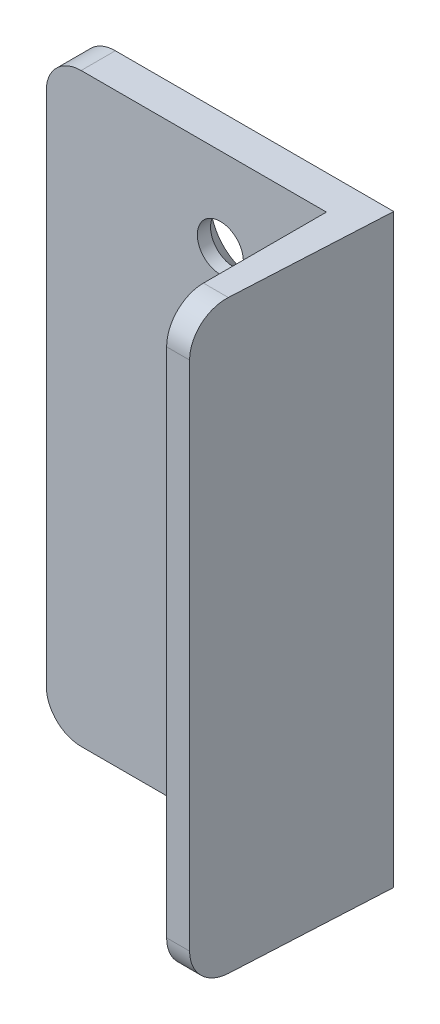
ISO-10303-21;
HEADER;
FILE_DESCRIPTION(('STEP AP214'),'2;1');
FILE_NAME('part.step','',(''),(''),'','','');
FILE_SCHEMA(('AUTOMOTIVE_DESIGN { 1 0 10303 214 1 1 1 1 }'));
ENDSEC;
DATA;
#1=APPLICATION_CONTEXT('core data for automotive mechanical design processes');
#2=APPLICATION_PROTOCOL_DEFINITION('international standard','automotive_design',2000,#1);
#3=PRODUCT_CONTEXT('',#1,'mechanical');
#4=PRODUCT('Part','Part','',(#3));
#5=PRODUCT_RELATED_PRODUCT_CATEGORY('part','',(#4));
#6=PRODUCT_DEFINITION_FORMATION('','',#4);
#7=PRODUCT_DEFINITION_CONTEXT('part definition',#1,'design');
#8=PRODUCT_DEFINITION('design','',#6,#7);
#9=PRODUCT_DEFINITION_SHAPE('','',#8);
#10=(LENGTH_UNIT() NAMED_UNIT(*) SI_UNIT(.MILLI.,.METRE.));
#11=(NAMED_UNIT(*) PLANE_ANGLE_UNIT() SI_UNIT($,.RADIAN.));
#12=(NAMED_UNIT(*) SI_UNIT($,.STERADIAN.) SOLID_ANGLE_UNIT());
#13=UNCERTAINTY_MEASURE_WITH_UNIT(LENGTH_MEASURE(1.E-05),#10,'distance_accuracy_value','');
#14=(GEOMETRIC_REPRESENTATION_CONTEXT(3) GLOBAL_UNCERTAINTY_ASSIGNED_CONTEXT((#13)) GLOBAL_UNIT_ASSIGNED_CONTEXT((#10,
#11,#12)) REPRESENTATION_CONTEXT('',''));
#15=CARTESIAN_POINT('',(0.,0.,0.));
#16=DIRECTION('',(0.,0.,1.));
#17=DIRECTION('',(1.,0.,0.));
#18=AXIS2_PLACEMENT_3D('',#15,#16,#17);
#19=CARTESIAN_POINT('',(-17.45,41.95,4.9));
#20=DIRECTION('',(0.,-1.,0.));
#21=DIRECTION('',(0.,0.,-1.));
#22=AXIS2_PLACEMENT_3D('',#19,#20,#21);
#23=PLANE('',#22);
#24=DIRECTION('',(-0.0523359562429439,0.,0.998629534754574));
#25=VECTOR('',#24,1.);
#26=CARTESIAN_POINT('',(22.45,41.95,0.));
#27=LINE('',#26,#25);
#28=CARTESIAN_POINT('',(22.45,41.95,0.));
#29=VERTEX_POINT('',#28);
#30=CARTESIAN_POINT('',(21.2694357276491,41.9499989350488,22.5265082493754));
#31=VERTEX_POINT('',#30);
#32=EDGE_CURVE('E120',#29,#31,#27,.T.);
#33=ORIENTED_EDGE('',*,*,#32,.F.);
#34=DIRECTION('',(-1.,0.,0.));
#35=VECTOR('',#34,1.);
#36=CARTESIAN_POINT('',(-17.45,41.95,0.));
#37=LINE('',#36,#35);
#38=CARTESIAN_POINT('',(-17.45,41.95,0.));
#39=VERTEX_POINT('',#38);
#40=EDGE_CURVE('E128',#29,#39,#37,.T.);
#41=ORIENTED_EDGE('',*,*,#40,.T.);
#42=DIRECTION('',(0.,0.,-1.));
#43=VECTOR('',#42,1.);
#44=CARTESIAN_POINT('',(-17.45,41.95,4.9));
#45=LINE('',#44,#43);
#46=CARTESIAN_POINT('',(-17.45,41.95,4.9));
#47=VERTEX_POINT('',#46);
#48=EDGE_CURVE('E164',#47,#39,#45,.T.);
#49=ORIENTED_EDGE('',*,*,#48,.F.);
#50=DIRECTION('',(-1.,0.,0.));
#51=VECTOR('',#50,1.);
#52=CARTESIAN_POINT('',(-17.45,41.95,4.9));
#53=LINE('',#52,#51);
#54=CARTESIAN_POINT('',(17.7,41.95,4.9));
#55=VERTEX_POINT('',#54);
#56=EDGE_CURVE('E153',#55,#47,#53,.T.);
#57=ORIENTED_EDGE('',*,*,#56,.F.);
#58=DIRECTION('',(0.,0.,-1.));
#59=VECTOR('',#58,1.);
#60=CARTESIAN_POINT('',(17.7,41.95,27.8));
#61=LINE('',#60,#59);
#62=CARTESIAN_POINT('',(17.7,41.95,22.5265082493754));
#63=VERTEX_POINT('',#62);
#64=EDGE_CURVE('E129',#63,#55,#61,.T.);
#65=ORIENTED_EDGE('',*,*,#64,.F.);
#66=DIRECTION('',(1.,0.,0.));
#67=VECTOR('',#66,1.);
#68=CARTESIAN_POINT('',(-5.3,41.95,22.5265082493754));
#69=LINE('',#68,#67);
#70=EDGE_CURVE('E136',#63,#31,#69,.T.);
#71=ORIENTED_EDGE('',*,*,#70,.T.);
#72=EDGE_LOOP('',(#33,#41,#49,#57,#65,#71));
#73=FACE_BOUND('',#72,.T.);
#74=ADVANCED_FACE('F43',(#73),#23,.F.);
#75=CARTESIAN_POINT('',(0.,0.,27.8));
#76=DIRECTION('',(0.,0.,-1.));
#77=DIRECTION('',(-1.,0.,0.));
#78=AXIS2_PLACEMENT_3D('',#75,#76,#77);
#79=PLANE('',#78);
#80=DIRECTION('',(0.,-1.,0.));
#81=VECTOR('',#80,1.);
#82=CARTESIAN_POINT('',(20.9930637359315,0.,27.8));
#83=LINE('',#82,#81);
#84=CARTESIAN_POINT('',(20.9930637359315,36.6765039895697,27.8));
#85=VERTEX_POINT('',#84);
#86=CARTESIAN_POINT('',(20.9930637359315,-36.6765061194722,27.8));
#87=VERTEX_POINT('',#86);
#88=EDGE_CURVE('E56',#85,#87,#83,.T.);
#89=ORIENTED_EDGE('',*,*,#88,.F.);
#90=DIRECTION('',(1.,0.,0.));
#91=VECTOR('',#90,1.);
#92=CARTESIAN_POINT('',(-5.3,36.6765039895697,27.8000015974273));
#93=LINE('',#92,#91);
#94=CARTESIAN_POINT('',(17.7,36.6765039895697,27.8));
#95=VERTEX_POINT('',#94);
#96=EDGE_CURVE('E63',#85,#95,#93,.F.);
#97=ORIENTED_EDGE('',*,*,#96,.T.);
#98=DIRECTION('',(0.,-1.,0.));
#99=VECTOR('',#98,1.);
#100=CARTESIAN_POINT('',(17.7,41.95,27.8));
#101=LINE('',#100,#99);
#102=CARTESIAN_POINT('',(17.7,-36.6765061194722,27.8));
#103=VERTEX_POINT('',#102);
#104=EDGE_CURVE('E174',#95,#103,#101,.T.);
#105=ORIENTED_EDGE('',*,*,#104,.T.);
#106=DIRECTION('',(1.,0.,0.));
#107=VECTOR('',#106,1.);
#108=CARTESIAN_POINT('',(-5.3,-36.6765061194722,27.8));
#109=LINE('',#108,#107);
#110=EDGE_CURVE('E50',#87,#103,#109,.F.);
#111=ORIENTED_EDGE('',*,*,#110,.F.);
#112=EDGE_LOOP('',(#89,#97,#105,#111));
#113=FACE_BOUND('',#112,.T.);
#114=ADVANCED_FACE('F175',(#113),#79,.F.);
#115=CARTESIAN_POINT('',(-17.45,-41.95,4.9));
#116=DIRECTION('',(0.,1.,0.));
#117=DIRECTION('',(0.,0.,1.));
#118=AXIS2_PLACEMENT_3D('',#115,#116,#117);
#119=PLANE('',#118);
#120=DIRECTION('',(0.0523359562429439,0.,-0.998629534754574));
#121=VECTOR('',#120,1.);
#122=CARTESIAN_POINT('',(22.45,-41.95,0.));
#123=LINE('',#122,#121);
#124=CARTESIAN_POINT('',(21.2694358392726,-41.95,22.5265061194722));
#125=VERTEX_POINT('',#124);
#126=CARTESIAN_POINT('',(22.45,-41.95,0.));
#127=VERTEX_POINT('',#126);
#128=EDGE_CURVE('E123',#125,#127,#123,.T.);
#129=ORIENTED_EDGE('',*,*,#128,.F.);
#130=DIRECTION('',(1.,0.,0.));
#131=VECTOR('',#130,1.);
#132=CARTESIAN_POINT('',(-5.3,-41.95,22.5265059343001));
#133=LINE('',#132,#131);
#134=CARTESIAN_POINT('',(17.7,-41.95,22.5265059343001));
#135=VERTEX_POINT('',#134);
#136=EDGE_CURVE('E187',#135,#125,#133,.T.);
#137=ORIENTED_EDGE('',*,*,#136,.F.);
#138=DIRECTION('',(0.,0.,-1.));
#139=VECTOR('',#138,1.);
#140=CARTESIAN_POINT('',(17.7,-41.95,27.8));
#141=LINE('',#140,#139);
#142=CARTESIAN_POINT('',(17.7,-41.95,4.9));
#143=VERTEX_POINT('',#142);
#144=EDGE_CURVE('E178',#135,#143,#141,.T.);
#145=ORIENTED_EDGE('',*,*,#144,.T.);
#146=DIRECTION('',(1.,0.,0.));
#147=VECTOR('',#146,1.);
#148=CARTESIAN_POINT('',(-17.45,-41.95,4.9));
#149=LINE('',#148,#147);
#150=CARTESIAN_POINT('',(-17.45,-41.95,4.9));
#151=VERTEX_POINT('',#150);
#152=EDGE_CURVE('E158',#151,#143,#149,.T.);
#153=ORIENTED_EDGE('',*,*,#152,.F.);
#154=DIRECTION('',(0.,0.,-1.));
#155=VECTOR('',#154,1.);
#156=CARTESIAN_POINT('',(-17.45,-41.95,4.9));
#157=LINE('',#156,#155);
#158=CARTESIAN_POINT('',(-17.45,-41.95,0.));
#159=VERTEX_POINT('',#158);
#160=EDGE_CURVE('E154',#151,#159,#157,.T.);
#161=ORIENTED_EDGE('',*,*,#160,.T.);
#162=DIRECTION('',(1.,0.,0.));
#163=VECTOR('',#162,1.);
#164=CARTESIAN_POINT('',(-17.45,-41.95,0.));
#165=LINE('',#164,#163);
#166=EDGE_CURVE('E151',#159,#127,#165,.T.);
#167=ORIENTED_EDGE('',*,*,#166,.T.);
#168=EDGE_LOOP('',(#129,#137,#145,#153,#161,#167));
#169=FACE_BOUND('',#168,.T.);
#170=ADVANCED_FACE('F219',(#169),#119,.F.);
#171=CARTESIAN_POINT('',(-5.3,36.6765039895697,22.5265082493754));
#172=DIRECTION('',(1.,0.,0.));
#173=DIRECTION('',(0.,0.,-1.));
#174=AXIS2_PLACEMENT_3D('',#171,#172,#173);
#175=CYLINDRICAL_SURFACE('',#174,5.27349494547906);
#176=CARTESIAN_POINT('',(21.2694357276491,36.6765039895697,22.5265082493754));
#177=DIRECTION('',(0.998629534754574,0.,0.0523359562429439));
#178=DIRECTION('',(0.052335956242944,0.,-0.998629534754574));
#179=AXIS2_PLACEMENT_3D('',#176,#177,#178);
#180=ELLIPSE('',#179,5.28073200516254,5.27349494547906);
#181=EDGE_CURVE('E241',#31,#85,#180,.T.);
#182=ORIENTED_EDGE('',*,*,#181,.F.);
#183=ORIENTED_EDGE('',*,*,#70,.F.);
#184=CARTESIAN_POINT('',(17.7,36.6765039895697,22.5265082493754));
#185=DIRECTION('',(1.,0.,0.));
#186=DIRECTION('',(0.,1.,0.));
#187=AXIS2_PLACEMENT_3D('',#184,#185,#186);
#188=CIRCLE('',#187,5.27349494547906);
#189=EDGE_CURVE('E184',#95,#63,#188,.F.);
#190=ORIENTED_EDGE('',*,*,#189,.F.);
#191=ORIENTED_EDGE('',*,*,#96,.F.);
#192=EDGE_LOOP('',(#182,#183,#190,#191));
#193=FACE_BOUND('',#192,.T.);
#194=ADVANCED_FACE('F244',(#193),#175,.T.);
#195=CARTESIAN_POINT('',(-5.3,-36.6765061194722,22.5265061194722));
#196=DIRECTION('',(1.,0.,0.));
#197=DIRECTION('',(0.,0.,-1.));
#198=AXIS2_PLACEMENT_3D('',#195,#196,#197);
#199=CYLINDRICAL_SURFACE('',#198,5.27349388052784);
#200=CARTESIAN_POINT('',(21.2694358392726,-36.6765061194722,22.5265061194722));
#201=DIRECTION('',(0.998629534754574,0.,0.0523359562429439));
#202=DIRECTION('',(0.052335956242944,0.,-0.998629534754574));
#203=AXIS2_PLACEMENT_3D('',#200,#201,#202);
#204=ELLIPSE('',#203,5.28073093874985,5.27349388052784);
#205=EDGE_CURVE('E11',#87,#125,#204,.T.);
#206=ORIENTED_EDGE('',*,*,#205,.F.);
#207=ORIENTED_EDGE('',*,*,#110,.T.);
#208=CARTESIAN_POINT('',(17.7,-36.6765061194722,22.5265061194722));
#209=DIRECTION('',(1.,0.,0.));
#210=DIRECTION('',(0.,1.,0.));
#211=AXIS2_PLACEMENT_3D('',#208,#209,#210);
#212=CIRCLE('',#211,5.27349388052784);
#213=EDGE_CURVE('E171',#135,#103,#212,.F.);
#214=ORIENTED_EDGE('',*,*,#213,.F.);
#215=ORIENTED_EDGE('',*,*,#136,.T.);
#216=EDGE_LOOP('',(#206,#207,#214,#215));
#217=FACE_BOUND('',#216,.T.);
#218=ADVANCED_FACE('F168',(#217),#199,.T.);
#219=CARTESIAN_POINT('',(-17.45,36.95,0.));
#220=DIRECTION('',(0.,0.,1.));
#221=DIRECTION('',(1.,0.,0.));
#222=AXIS2_PLACEMENT_3D('',#219,#220,#221);
#223=PLANE('',#222);
#224=DIRECTION('',(0.,1.,0.));
#225=VECTOR('',#224,1.);
#226=CARTESIAN_POINT('',(22.45,-41.95,0.));
#227=LINE('',#226,#225);
#228=EDGE_CURVE('E117',#127,#29,#227,.T.);
#229=ORIENTED_EDGE('',*,*,#228,.F.);
#230=ORIENTED_EDGE('',*,*,#166,.F.);
#231=CARTESIAN_POINT('',(-17.45,-36.95,0.));
#232=DIRECTION('',(0.,0.,1.));
#233=DIRECTION('',(1.,0.,0.));
#234=AXIS2_PLACEMENT_3D('',#231,#232,#233);
#235=CIRCLE('',#234,5.);
#236=CARTESIAN_POINT('',(-22.45,-36.95,0.));
#237=VERTEX_POINT('',#236);
#238=EDGE_CURVE('E149',#237,#159,#235,.T.);
#239=ORIENTED_EDGE('',*,*,#238,.F.);
#240=DIRECTION('',(0.,-1.,0.));
#241=VECTOR('',#240,1.);
#242=CARTESIAN_POINT('',(-22.45,-36.95,0.));
#243=LINE('',#242,#241);
#244=CARTESIAN_POINT('',(-22.45,36.95,0.));
#245=VERTEX_POINT('',#244);
#246=EDGE_CURVE('E144',#245,#237,#243,.T.);
#247=ORIENTED_EDGE('',*,*,#246,.F.);
#248=CARTESIAN_POINT('',(-17.45,36.95,0.));
#249=DIRECTION('',(0.,0.,1.));
#250=DIRECTION('',(1.,0.,0.));
#251=AXIS2_PLACEMENT_3D('',#248,#249,#250);
#252=CIRCLE('',#251,5.);
#253=EDGE_CURVE('E142',#39,#245,#252,.T.);
#254=ORIENTED_EDGE('',*,*,#253,.F.);
#255=ORIENTED_EDGE('',*,*,#40,.F.);
#256=EDGE_LOOP('',(#229,#230,#239,#247,#254,#255));
#257=FACE_BOUND('',#256,.T.);
#258=CARTESIAN_POINT('',(2.50000000000002,-29.8956518577535,0.));
#259=DIRECTION('',(0.,0.,-1.));
#260=DIRECTION('',(-1.,0.,0.));
#261=AXIS2_PLACEMENT_3D('',#258,#259,#260);
#262=CIRCLE('',#261,6.3);
#263=CARTESIAN_POINT('',(-3.79999999999998,-29.8956518577535,0.));
#264=VERTEX_POINT('',#263);
#265=EDGE_CURVE('E229',#264,#264,#262,.T.);
#266=ORIENTED_EDGE('',*,*,#265,.F.);
#267=EDGE_LOOP('',(#266));
#268=FACE_BOUND('',#267,.T.);
#269=CARTESIAN_POINT('',(2.50000000000002,29.8956518577535,0.));
#270=DIRECTION('',(0.,0.,-1.));
#271=DIRECTION('',(-1.,0.,0.));
#272=AXIS2_PLACEMENT_3D('',#269,#270,#271);
#273=CIRCLE('',#272,6.3);
#274=CARTESIAN_POINT('',(-3.79999999999998,29.8956518577535,0.));
#275=VERTEX_POINT('',#274);
#276=EDGE_CURVE('E238',#275,#275,#273,.T.);
#277=ORIENTED_EDGE('',*,*,#276,.F.);
#278=EDGE_LOOP('',(#277));
#279=FACE_BOUND('',#278,.T.);
#280=ADVANCED_FACE('F139',(#257,#268,#279),#223,.F.);
#281=CARTESIAN_POINT('',(-17.45,36.95,4.9));
#282=DIRECTION('',(0.,0.,-1.));
#283=DIRECTION('',(-1.,0.,0.));
#284=AXIS2_PLACEMENT_3D('',#281,#282,#283);
#285=CYLINDRICAL_SURFACE('',#284,5.);
#286=ORIENTED_EDGE('',*,*,#253,.T.);
#287=DIRECTION('',(0.,0.,-1.));
#288=VECTOR('',#287,1.);
#289=CARTESIAN_POINT('',(-22.45,36.95,4.9));
#290=LINE('',#289,#288);
#291=CARTESIAN_POINT('',(-22.45,36.95,4.9));
#292=VERTEX_POINT('',#291);
#293=EDGE_CURVE('E161',#292,#245,#290,.T.);
#294=ORIENTED_EDGE('',*,*,#293,.F.);
#295=CARTESIAN_POINT('',(-17.45,36.95,4.9));
#296=DIRECTION('',(0.,0.,1.));
#297=DIRECTION('',(1.,0.,0.));
#298=AXIS2_PLACEMENT_3D('',#295,#296,#297);
#299=CIRCLE('',#298,5.);
#300=EDGE_CURVE('E194',#47,#292,#299,.T.);
#301=ORIENTED_EDGE('',*,*,#300,.F.);
#302=ORIENTED_EDGE('',*,*,#48,.T.);
#303=EDGE_LOOP('',(#286,#294,#301,#302));
#304=FACE_BOUND('',#303,.T.);
#305=ADVANCED_FACE('F213',(#304),#285,.T.);
#306=CARTESIAN_POINT('',(-22.45,-36.95,4.9));
#307=DIRECTION('',(1.,0.,0.));
#308=DIRECTION('',(0.,0.,-1.));
#309=AXIS2_PLACEMENT_3D('',#306,#307,#308);
#310=PLANE('',#309);
#311=ORIENTED_EDGE('',*,*,#246,.T.);
#312=DIRECTION('',(0.,0.,-1.));
#313=VECTOR('',#312,1.);
#314=CARTESIAN_POINT('',(-22.45,-36.95,4.9));
#315=LINE('',#314,#313);
#316=CARTESIAN_POINT('',(-22.45,-36.95,4.9));
#317=VERTEX_POINT('',#316);
#318=EDGE_CURVE('E157',#317,#237,#315,.T.);
#319=ORIENTED_EDGE('',*,*,#318,.F.);
#320=DIRECTION('',(0.,-1.,0.));
#321=VECTOR('',#320,1.);
#322=CARTESIAN_POINT('',(-22.45,-36.95,4.9));
#323=LINE('',#322,#321);
#324=EDGE_CURVE('E196',#292,#317,#323,.T.);
#325=ORIENTED_EDGE('',*,*,#324,.F.);
#326=ORIENTED_EDGE('',*,*,#293,.T.);
#327=EDGE_LOOP('',(#311,#319,#325,#326));
#328=FACE_BOUND('',#327,.T.);
#329=ADVANCED_FACE('F215',(#328),#310,.F.);
#330=CARTESIAN_POINT('',(-17.45,-36.95,4.9));
#331=DIRECTION('',(0.,0.,-1.));
#332=DIRECTION('',(-1.,0.,0.));
#333=AXIS2_PLACEMENT_3D('',#330,#331,#332);
#334=CYLINDRICAL_SURFACE('',#333,5.);
#335=ORIENTED_EDGE('',*,*,#238,.T.);
#336=ORIENTED_EDGE('',*,*,#160,.F.);
#337=CARTESIAN_POINT('',(-17.45,-36.95,4.9));
#338=DIRECTION('',(0.,0.,1.));
#339=DIRECTION('',(1.,0.,0.));
#340=AXIS2_PLACEMENT_3D('',#337,#338,#339);
#341=CIRCLE('',#340,5.);
#342=EDGE_CURVE('E198',#317,#151,#341,.T.);
#343=ORIENTED_EDGE('',*,*,#342,.F.);
#344=ORIENTED_EDGE('',*,*,#318,.T.);
#345=EDGE_LOOP('',(#335,#336,#343,#344));
#346=FACE_BOUND('',#345,.T.);
#347=ADVANCED_FACE('F218',(#346),#334,.T.);
#348=CARTESIAN_POINT('',(-17.45,36.95,4.9));
#349=DIRECTION('',(0.,0.,1.));
#350=DIRECTION('',(1.,0.,0.));
#351=AXIS2_PLACEMENT_3D('',#348,#349,#350);
#352=PLANE('',#351);
#353=CARTESIAN_POINT('',(2.50000000000002,29.8956518577535,4.9));
#354=DIRECTION('',(0.,0.,1.));
#355=DIRECTION('',(1.,0.,0.));
#356=AXIS2_PLACEMENT_3D('',#353,#354,#355);
#357=CIRCLE('',#356,3.3);
#358=CARTESIAN_POINT('',(5.80000000000002,29.8956518577535,4.9));
#359=VERTEX_POINT('',#358);
#360=EDGE_CURVE('E232',#359,#359,#357,.T.);
#361=ORIENTED_EDGE('',*,*,#360,.F.);
#362=EDGE_LOOP('',(#361));
#363=FACE_BOUND('',#362,.T.);
#364=CARTESIAN_POINT('',(2.50000000000002,-29.8956518577535,4.9));
#365=DIRECTION('',(0.,0.,1.));
#366=DIRECTION('',(1.,0.,0.));
#367=AXIS2_PLACEMENT_3D('',#364,#365,#366);
#368=CIRCLE('',#367,3.3);
#369=CARTESIAN_POINT('',(5.80000000000001,-29.8956518577535,4.9));
#370=VERTEX_POINT('',#369);
#371=EDGE_CURVE('E222',#370,#370,#368,.T.);
#372=ORIENTED_EDGE('',*,*,#371,.F.);
#373=EDGE_LOOP('',(#372));
#374=FACE_BOUND('',#373,.T.);
#375=DIRECTION('',(0.,-1.,0.));
#376=VECTOR('',#375,1.);
#377=CARTESIAN_POINT('',(17.7,41.95,4.9));
#378=LINE('',#377,#376);
#379=EDGE_CURVE('E179',#55,#143,#378,.T.);
#380=ORIENTED_EDGE('',*,*,#379,.F.);
#381=ORIENTED_EDGE('',*,*,#56,.T.);
#382=ORIENTED_EDGE('',*,*,#300,.T.);
#383=ORIENTED_EDGE('',*,*,#324,.T.);
#384=ORIENTED_EDGE('',*,*,#342,.T.);
#385=ORIENTED_EDGE('',*,*,#152,.T.);
#386=EDGE_LOOP('',(#380,#381,#382,#383,#384,#385));
#387=FACE_BOUND('',#386,.T.);
#388=ADVANCED_FACE('F203',(#363,#374,#387),#352,.T.);
#389=CARTESIAN_POINT('',(17.7,41.95,27.8));
#390=DIRECTION('',(1.,0.,0.));
#391=DIRECTION('',(0.,1.,0.));
#392=AXIS2_PLACEMENT_3D('',#389,#390,#391);
#393=PLANE('',#392);
#394=ORIENTED_EDGE('',*,*,#144,.F.);
#395=ORIENTED_EDGE('',*,*,#213,.T.);
#396=ORIENTED_EDGE('',*,*,#104,.F.);
#397=ORIENTED_EDGE('',*,*,#189,.T.);
#398=ORIENTED_EDGE('',*,*,#64,.T.);
#399=ORIENTED_EDGE('',*,*,#379,.T.);
#400=EDGE_LOOP('',(#394,#395,#396,#397,#398,#399));
#401=FACE_BOUND('',#400,.T.);
#402=ADVANCED_FACE('F182',(#401),#393,.F.);
#403=CARTESIAN_POINT('',(2.50000000000002,-29.8956518577535,0.));
#404=DIRECTION('',(0.,0.,-1.));
#405=DIRECTION('',(-1.,0.,0.));
#406=AXIS2_PLACEMENT_3D('',#403,#404,#405);
#407=CYLINDRICAL_SURFACE('',#406,3.3);
#408=CARTESIAN_POINT('',(2.50000000000002,-29.8956518577535,3.));
#409=DIRECTION('',(0.,0.,-1.));
#410=DIRECTION('',(-1.,0.,0.));
#411=AXIS2_PLACEMENT_3D('',#408,#409,#410);
#412=CIRCLE('',#411,3.3);
#413=CARTESIAN_POINT('',(-0.799999999999984,-29.8956518577535,3.));
#414=VERTEX_POINT('',#413);
#415=EDGE_CURVE('E226',#414,#414,#412,.T.);
#416=ORIENTED_EDGE('',*,*,#415,.T.);
#417=EDGE_LOOP('',(#416));
#418=FACE_BOUND('',#417,.T.);
#419=ORIENTED_EDGE('',*,*,#371,.T.);
#420=EDGE_LOOP('',(#419));
#421=FACE_BOUND('',#420,.T.);
#422=ADVANCED_FACE('F264',(#418,#421),#407,.F.);
#423=CARTESIAN_POINT('',(2.50000000000002,-29.8956518577535,0.));
#424=DIRECTION('',(0.,0.,-1.));
#425=DIRECTION('',(-1.,0.,0.));
#426=AXIS2_PLACEMENT_3D('',#423,#424,#425);
#427=CONICAL_SURFACE('',#426,6.3,0.785398163397448);
#428=ORIENTED_EDGE('',*,*,#415,.F.);
#429=EDGE_LOOP('',(#428));
#430=FACE_BOUND('',#429,.T.);
#431=ORIENTED_EDGE('',*,*,#265,.T.);
#432=EDGE_LOOP('',(#431));
#433=FACE_BOUND('',#432,.T.);
#434=ADVANCED_FACE('F304',(#430,#433),#427,.F.);
#435=CARTESIAN_POINT('',(2.50000000000002,29.8956518577535,0.));
#436=DIRECTION('',(0.,0.,-1.));
#437=DIRECTION('',(-1.,0.,0.));
#438=AXIS2_PLACEMENT_3D('',#435,#436,#437);
#439=CYLINDRICAL_SURFACE('',#438,3.3);
#440=CARTESIAN_POINT('',(2.50000000000002,29.8956518577535,3.));
#441=DIRECTION('',(0.,0.,-1.));
#442=DIRECTION('',(-1.,0.,0.));
#443=AXIS2_PLACEMENT_3D('',#440,#441,#442);
#444=CIRCLE('',#443,3.3);
#445=CARTESIAN_POINT('',(-0.799999999999984,29.8956518577535,3.));
#446=VERTEX_POINT('',#445);
#447=EDGE_CURVE('E235',#446,#446,#444,.T.);
#448=ORIENTED_EDGE('',*,*,#447,.T.);
#449=EDGE_LOOP('',(#448));
#450=FACE_BOUND('',#449,.T.);
#451=ORIENTED_EDGE('',*,*,#360,.T.);
#452=EDGE_LOOP('',(#451));
#453=FACE_BOUND('',#452,.T.);
#454=ADVANCED_FACE('F313',(#450,#453),#439,.F.);
#455=CARTESIAN_POINT('',(2.50000000000002,29.8956518577535,0.));
#456=DIRECTION('',(0.,0.,-1.));
#457=DIRECTION('',(-1.,0.,0.));
#458=AXIS2_PLACEMENT_3D('',#455,#456,#457);
#459=CONICAL_SURFACE('',#458,6.3,0.785398163397448);
#460=ORIENTED_EDGE('',*,*,#447,.F.);
#461=EDGE_LOOP('',(#460));
#462=FACE_BOUND('',#461,.T.);
#463=ORIENTED_EDGE('',*,*,#276,.T.);
#464=EDGE_LOOP('',(#463));
#465=FACE_BOUND('',#464,.T.);
#466=ADVANCED_FACE('F321',(#462,#465),#459,.F.);
#467=CARTESIAN_POINT('',(22.45,0.,0.));
#468=DIRECTION('',(0.998629534754574,0.,0.0523359562429439));
#469=DIRECTION('',(0.0523359562429439,0.,-0.998629534754574));
#470=AXIS2_PLACEMENT_3D('',#467,#468,#469);
#471=PLANE('',#470);
#472=ORIENTED_EDGE('',*,*,#181,.T.);
#473=ORIENTED_EDGE('',*,*,#88,.T.);
#474=ORIENTED_EDGE('',*,*,#205,.T.);
#475=ORIENTED_EDGE('',*,*,#128,.T.);
#476=ORIENTED_EDGE('',*,*,#228,.T.);
#477=ORIENTED_EDGE('',*,*,#32,.T.);
#478=EDGE_LOOP('',(#472,#473,#474,#475,#476,#477));
#479=FACE_BOUND('',#478,.T.);
#480=ADVANCED_FACE('F119',(#479),#471,.T.);
#481=CLOSED_SHELL('',(#74,#114,#170,#194,#218,#280,#305,#329,#347,#388,#402,#422,#434,#454,#466,#480));
#482=MANIFOLD_SOLID_BREP('B2',#481);
#483=ADVANCED_BREP_SHAPE_REPRESENTATION('',(#18,#482),#14);
#484=SHAPE_DEFINITION_REPRESENTATION(#9,#483);
ENDSEC;
END-ISO-10303-21;
